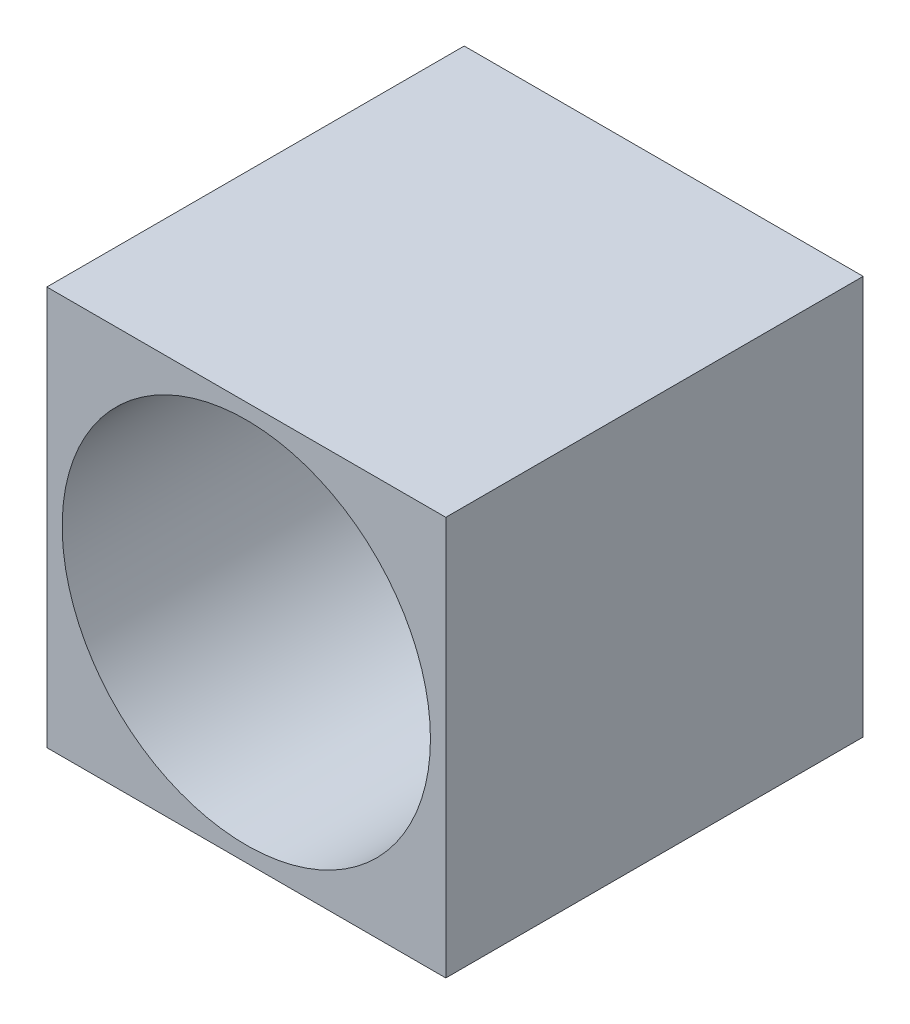
ISO-10303-21;
HEADER;
FILE_DESCRIPTION(('STEP AP214'),'2;1');
FILE_NAME('part.step','',(''),(''),'','','');
FILE_SCHEMA(('AUTOMOTIVE_DESIGN { 1 0 10303 214 1 1 1 1 }'));
ENDSEC;
DATA;
#1=APPLICATION_CONTEXT('core data for automotive mechanical design processes');
#2=APPLICATION_PROTOCOL_DEFINITION('international standard','automotive_design',2000,#1);
#3=PRODUCT_CONTEXT('',#1,'mechanical');
#4=PRODUCT('Part','Part','',(#3));
#5=PRODUCT_RELATED_PRODUCT_CATEGORY('part','',(#4));
#6=PRODUCT_DEFINITION_FORMATION('','',#4);
#7=PRODUCT_DEFINITION_CONTEXT('part definition',#1,'design');
#8=PRODUCT_DEFINITION('design','',#6,#7);
#9=PRODUCT_DEFINITION_SHAPE('','',#8);
#10=(LENGTH_UNIT() NAMED_UNIT(*) SI_UNIT(.MILLI.,.METRE.));
#11=(NAMED_UNIT(*) PLANE_ANGLE_UNIT() SI_UNIT($,.RADIAN.));
#12=(NAMED_UNIT(*) SI_UNIT($,.STERADIAN.) SOLID_ANGLE_UNIT());
#13=UNCERTAINTY_MEASURE_WITH_UNIT(LENGTH_MEASURE(1.E-05),#10,'distance_accuracy_value','');
#14=(GEOMETRIC_REPRESENTATION_CONTEXT(3) GLOBAL_UNCERTAINTY_ASSIGNED_CONTEXT((#13)) GLOBAL_UNIT_ASSIGNED_CONTEXT((#10,
#11,#12)) REPRESENTATION_CONTEXT('',''));
#15=CARTESIAN_POINT('',(0.,0.,0.));
#16=DIRECTION('',(0.,0.,1.));
#17=DIRECTION('',(1.,0.,0.));
#18=AXIS2_PLACEMENT_3D('',#15,#16,#17);
#19=CARTESIAN_POINT('',(-1.625,1.625,0.));
#20=DIRECTION('',(-1.,0.,0.));
#21=DIRECTION('',(0.,0.,1.));
#22=AXIS2_PLACEMENT_3D('',#19,#20,#21);
#23=PLANE('',#22);
#24=DIRECTION('',(0.,1.,0.));
#25=VECTOR('',#24,1.);
#26=CARTESIAN_POINT('',(-1.625,0.,3.4));
#27=LINE('',#26,#25);
#28=CARTESIAN_POINT('',(-1.625,1.625,3.4));
#29=VERTEX_POINT('',#28);
#30=CARTESIAN_POINT('',(-1.625,-1.625,3.4));
#31=VERTEX_POINT('',#30);
#32=EDGE_CURVE('E89',#29,#31,#27,.F.);
#33=ORIENTED_EDGE('',*,*,#32,.F.);
#34=DIRECTION('',(0.,0.,1.));
#35=VECTOR('',#34,1.);
#36=CARTESIAN_POINT('',(-1.625,1.625,0.));
#37=LINE('',#36,#35);
#38=CARTESIAN_POINT('',(-1.625,1.625,0.));
#39=VERTEX_POINT('',#38);
#40=EDGE_CURVE('E64',#39,#29,#37,.T.);
#41=ORIENTED_EDGE('',*,*,#40,.F.);
#42=DIRECTION('',(0.,1.,0.));
#43=VECTOR('',#42,1.);
#44=CARTESIAN_POINT('',(-1.625,0.,0.));
#45=LINE('',#44,#43);
#46=CARTESIAN_POINT('',(-1.625,-1.625,0.));
#47=VERTEX_POINT('',#46);
#48=EDGE_CURVE('E92',#39,#47,#45,.F.);
#49=ORIENTED_EDGE('',*,*,#48,.T.);
#50=DIRECTION('',(0.,0.,-1.));
#51=VECTOR('',#50,1.);
#52=CARTESIAN_POINT('',(-1.625,-1.625,0.));
#53=LINE('',#52,#51);
#54=EDGE_CURVE('E54',#31,#47,#53,.T.);
#55=ORIENTED_EDGE('',*,*,#54,.F.);
#56=EDGE_LOOP('',(#33,#41,#49,#55));
#57=FACE_BOUND('',#56,.T.);
#58=ADVANCED_FACE('F17',(#57),#23,.T.);
#59=CARTESIAN_POINT('',(-1.625,-1.625,0.));
#60=DIRECTION('',(0.,-1.,0.));
#61=DIRECTION('',(0.,0.,-1.));
#62=AXIS2_PLACEMENT_3D('',#59,#60,#61);
#63=PLANE('',#62);
#64=DIRECTION('',(1.,0.,0.));
#65=VECTOR('',#64,1.);
#66=CARTESIAN_POINT('',(0.,-1.625,3.4));
#67=LINE('',#66,#65);
#68=CARTESIAN_POINT('',(1.625,-1.625,3.4));
#69=VERTEX_POINT('',#68);
#70=EDGE_CURVE('E91',#31,#69,#67,.T.);
#71=ORIENTED_EDGE('',*,*,#70,.F.);
#72=ORIENTED_EDGE('',*,*,#54,.T.);
#73=DIRECTION('',(1.,0.,0.));
#74=VECTOR('',#73,1.);
#75=CARTESIAN_POINT('',(0.,-1.625,0.));
#76=LINE('',#75,#74);
#77=CARTESIAN_POINT('',(1.625,-1.625,0.));
#78=VERTEX_POINT('',#77);
#79=EDGE_CURVE('E70',#47,#78,#76,.T.);
#80=ORIENTED_EDGE('',*,*,#79,.T.);
#81=DIRECTION('',(0.,0.,-1.));
#82=VECTOR('',#81,1.);
#83=CARTESIAN_POINT('',(1.625,-1.625,0.));
#84=LINE('',#83,#82);
#85=EDGE_CURVE('E60',#69,#78,#84,.T.);
#86=ORIENTED_EDGE('',*,*,#85,.F.);
#87=EDGE_LOOP('',(#71,#72,#80,#86));
#88=FACE_BOUND('',#87,.T.);
#89=ADVANCED_FACE('F75',(#88),#63,.T.);
#90=CARTESIAN_POINT('',(1.625,-1.625,0.));
#91=DIRECTION('',(1.,0.,0.));
#92=DIRECTION('',(0.,0.,-1.));
#93=AXIS2_PLACEMENT_3D('',#90,#91,#92);
#94=PLANE('',#93);
#95=DIRECTION('',(0.,1.,0.));
#96=VECTOR('',#95,1.);
#97=CARTESIAN_POINT('',(1.625,0.,3.4));
#98=LINE('',#97,#96);
#99=CARTESIAN_POINT('',(1.625,1.625,3.4));
#100=VERTEX_POINT('',#99);
#101=EDGE_CURVE('E33',#69,#100,#98,.T.);
#102=ORIENTED_EDGE('',*,*,#101,.F.);
#103=ORIENTED_EDGE('',*,*,#85,.T.);
#104=DIRECTION('',(0.,1.,0.));
#105=VECTOR('',#104,1.);
#106=CARTESIAN_POINT('',(1.625,0.,0.));
#107=LINE('',#106,#105);
#108=CARTESIAN_POINT('',(1.625,1.625,0.));
#109=VERTEX_POINT('',#108);
#110=EDGE_CURVE('E63',#78,#109,#107,.T.);
#111=ORIENTED_EDGE('',*,*,#110,.T.);
#112=DIRECTION('',(0.,0.,1.));
#113=VECTOR('',#112,1.);
#114=CARTESIAN_POINT('',(1.625,1.625,0.));
#115=LINE('',#114,#113);
#116=EDGE_CURVE('E76',#100,#109,#115,.F.);
#117=ORIENTED_EDGE('',*,*,#116,.F.);
#118=EDGE_LOOP('',(#102,#103,#111,#117));
#119=FACE_BOUND('',#118,.T.);
#120=ADVANCED_FACE('F62',(#119),#94,.T.);
#121=CARTESIAN_POINT('',(1.625,1.625,0.));
#122=DIRECTION('',(0.,1.,0.));
#123=DIRECTION('',(0.,0.,1.));
#124=AXIS2_PLACEMENT_3D('',#121,#122,#123);
#125=PLANE('',#124);
#126=DIRECTION('',(1.,0.,0.));
#127=VECTOR('',#126,1.);
#128=CARTESIAN_POINT('',(0.,1.625,3.4));
#129=LINE('',#128,#127);
#130=EDGE_CURVE('E85',#100,#29,#129,.F.);
#131=ORIENTED_EDGE('',*,*,#130,.F.);
#132=ORIENTED_EDGE('',*,*,#116,.T.);
#133=DIRECTION('',(1.,0.,0.));
#134=VECTOR('',#133,1.);
#135=CARTESIAN_POINT('',(0.,1.625,0.));
#136=LINE('',#135,#134);
#137=EDGE_CURVE('E73',#109,#39,#136,.F.);
#138=ORIENTED_EDGE('',*,*,#137,.T.);
#139=ORIENTED_EDGE('',*,*,#40,.T.);
#140=EDGE_LOOP('',(#131,#132,#138,#139));
#141=FACE_BOUND('',#140,.T.);
#142=ADVANCED_FACE('F84',(#141),#125,.T.);
#143=CARTESIAN_POINT('',(0.,0.,0.));
#144=DIRECTION('',(0.,0.,1.));
#145=DIRECTION('',(1.,0.,0.));
#146=AXIS2_PLACEMENT_3D('',#143,#144,#145);
#147=PLANE('',#146);
#148=CARTESIAN_POINT('',(0.,0.,0.));
#149=DIRECTION('',(0.,0.,1.));
#150=DIRECTION('',(1.,0.,0.));
#151=AXIS2_PLACEMENT_3D('',#148,#149,#150);
#152=CIRCLE('',#151,1.5);
#153=CARTESIAN_POINT('',(1.5,0.,0.));
#154=VERTEX_POINT('',#153);
#155=EDGE_CURVE('E20',#154,#154,#152,.T.);
#156=ORIENTED_EDGE('',*,*,#155,.T.);
#157=EDGE_LOOP('',(#156));
#158=FACE_BOUND('',#157,.T.);
#159=ORIENTED_EDGE('',*,*,#137,.F.);
#160=ORIENTED_EDGE('',*,*,#110,.F.);
#161=ORIENTED_EDGE('',*,*,#79,.F.);
#162=ORIENTED_EDGE('',*,*,#48,.F.);
#163=EDGE_LOOP('',(#159,#160,#161,#162));
#164=FACE_BOUND('',#163,.T.);
#165=ADVANCED_FACE('F68',(#158,#164),#147,.F.);
#166=CARTESIAN_POINT('',(0.,0.,3.4));
#167=DIRECTION('',(0.,0.,1.));
#168=DIRECTION('',(1.,0.,0.));
#169=AXIS2_PLACEMENT_3D('',#166,#167,#168);
#170=PLANE('',#169);
#171=CARTESIAN_POINT('',(0.,0.,3.4));
#172=DIRECTION('',(0.,0.,1.));
#173=DIRECTION('',(1.,0.,0.));
#174=AXIS2_PLACEMENT_3D('',#171,#172,#173);
#175=CIRCLE('',#174,1.5);
#176=CARTESIAN_POINT('',(1.5,0.,3.4));
#177=VERTEX_POINT('',#176);
#178=EDGE_CURVE('E11',#177,#177,#175,.F.);
#179=ORIENTED_EDGE('',*,*,#178,.T.);
#180=EDGE_LOOP('',(#179));
#181=FACE_BOUND('',#180,.T.);
#182=ORIENTED_EDGE('',*,*,#101,.T.);
#183=ORIENTED_EDGE('',*,*,#130,.T.);
#184=ORIENTED_EDGE('',*,*,#32,.T.);
#185=ORIENTED_EDGE('',*,*,#70,.T.);
#186=EDGE_LOOP('',(#182,#183,#184,#185));
#187=FACE_BOUND('',#186,.T.);
#188=ADVANCED_FACE('F88',(#181,#187),#170,.T.);
#189=CARTESIAN_POINT('',(0.,0.,0.));
#190=DIRECTION('',(0.,0.,1.));
#191=DIRECTION('',(1.,0.,0.));
#192=AXIS2_PLACEMENT_3D('',#189,#190,#191);
#193=CYLINDRICAL_SURFACE('',#192,1.5);
#194=ORIENTED_EDGE('',*,*,#178,.F.);
#195=EDGE_LOOP('',(#194));
#196=FACE_BOUND('',#195,.T.);
#197=ORIENTED_EDGE('',*,*,#155,.F.);
#198=EDGE_LOOP('',(#197));
#199=FACE_BOUND('',#198,.T.);
#200=ADVANCED_FACE('F102',(#196,#199),#193,.F.);
#201=CLOSED_SHELL('',(#58,#89,#120,#142,#165,#188,#200));
#202=MANIFOLD_SOLID_BREP('B1',#201);
#203=ADVANCED_BREP_SHAPE_REPRESENTATION('',(#18,#202),#14);
#204=SHAPE_DEFINITION_REPRESENTATION(#9,#203);
ENDSEC;
END-ISO-10303-21;
